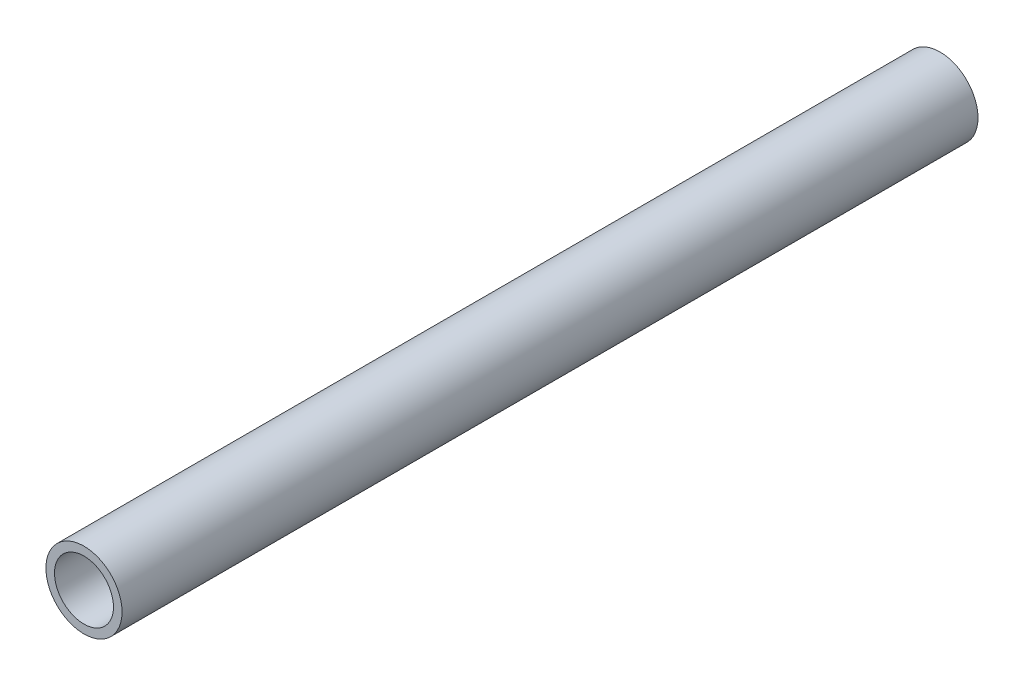
ISO-10303-21;
HEADER;
FILE_DESCRIPTION(('STEP AP214'),'2;1');
FILE_NAME('part.step','',(''),(''),'','','');
FILE_SCHEMA(('AUTOMOTIVE_DESIGN { 1 0 10303 214 1 1 1 1 }'));
ENDSEC;
DATA;
#1=APPLICATION_CONTEXT('core data for automotive mechanical design processes');
#2=APPLICATION_PROTOCOL_DEFINITION('international standard','automotive_design',2000,#1);
#3=PRODUCT_CONTEXT('',#1,'mechanical');
#4=PRODUCT('Part','Part','',(#3));
#5=PRODUCT_RELATED_PRODUCT_CATEGORY('part','',(#4));
#6=PRODUCT_DEFINITION_FORMATION('','',#4);
#7=PRODUCT_DEFINITION_CONTEXT('part definition',#1,'design');
#8=PRODUCT_DEFINITION('design','',#6,#7);
#9=PRODUCT_DEFINITION_SHAPE('','',#8);
#10=(LENGTH_UNIT() NAMED_UNIT(*) SI_UNIT(.MILLI.,.METRE.));
#11=(NAMED_UNIT(*) PLANE_ANGLE_UNIT() SI_UNIT($,.RADIAN.));
#12=(NAMED_UNIT(*) SI_UNIT($,.STERADIAN.) SOLID_ANGLE_UNIT());
#13=UNCERTAINTY_MEASURE_WITH_UNIT(LENGTH_MEASURE(1.E-05),#10,'distance_accuracy_value','');
#14=(GEOMETRIC_REPRESENTATION_CONTEXT(3) GLOBAL_UNCERTAINTY_ASSIGNED_CONTEXT((#13)) GLOBAL_UNIT_ASSIGNED_CONTEXT((#10,
#11,#12)) REPRESENTATION_CONTEXT('',''));
#15=CARTESIAN_POINT('',(0.,0.,0.));
#16=DIRECTION('',(0.,0.,1.));
#17=DIRECTION('',(1.,0.,0.));
#18=AXIS2_PLACEMENT_3D('',#15,#16,#17);
#19=CARTESIAN_POINT('',(0.,0.,150.));
#20=DIRECTION('',(0.,0.,1.));
#21=DIRECTION('',(1.,0.,0.));
#22=AXIS2_PLACEMENT_3D('',#19,#20,#21);
#23=PLANE('',#22);
#24=CARTESIAN_POINT('',(0.,0.,150.));
#25=DIRECTION('',(0.,0.,1.));
#26=DIRECTION('',(1.,0.,0.));
#27=AXIS2_PLACEMENT_3D('',#24,#25,#26);
#28=CIRCLE('',#27,13.335);
#29=CARTESIAN_POINT('',(13.335,0.,150.));
#30=VERTEX_POINT('',#29);
#31=EDGE_CURVE('E10',#30,#30,#28,.T.);
#32=ORIENTED_EDGE('',*,*,#31,.T.);
#33=EDGE_LOOP('',(#32));
#34=FACE_BOUND('',#33,.T.);
#35=CARTESIAN_POINT('',(0.,0.,150.));
#36=DIRECTION('',(0.,0.,1.));
#37=DIRECTION('',(1.,0.,0.));
#38=AXIS2_PLACEMENT_3D('',#35,#36,#37);
#39=CIRCLE('',#38,10.335);
#40=CARTESIAN_POINT('',(10.335,0.,150.));
#41=VERTEX_POINT('',#40);
#42=EDGE_CURVE('E54',#41,#41,#39,.T.);
#43=ORIENTED_EDGE('',*,*,#42,.F.);
#44=EDGE_LOOP('',(#43));
#45=FACE_BOUND('',#44,.T.);
#46=ADVANCED_FACE('F41',(#34,#45),#23,.T.);
#47=CARTESIAN_POINT('',(0.,0.,-150.));
#48=DIRECTION('',(0.,0.,1.));
#49=DIRECTION('',(1.,0.,0.));
#50=AXIS2_PLACEMENT_3D('',#47,#48,#49);
#51=PLANE('',#50);
#52=CARTESIAN_POINT('',(0.,0.,-150.));
#53=DIRECTION('',(0.,0.,1.));
#54=DIRECTION('',(1.,0.,0.));
#55=AXIS2_PLACEMENT_3D('',#52,#53,#54);
#56=CIRCLE('',#55,13.335);
#57=CARTESIAN_POINT('',(13.335,0.,-150.));
#58=VERTEX_POINT('',#57);
#59=EDGE_CURVE('E45',#58,#58,#56,.T.);
#60=ORIENTED_EDGE('',*,*,#59,.F.);
#61=EDGE_LOOP('',(#60));
#62=FACE_BOUND('',#61,.T.);
#63=CARTESIAN_POINT('',(0.,0.,-150.));
#64=DIRECTION('',(0.,0.,1.));
#65=DIRECTION('',(1.,0.,0.));
#66=AXIS2_PLACEMENT_3D('',#63,#64,#65);
#67=CIRCLE('',#66,10.335);
#68=CARTESIAN_POINT('',(10.335,0.,-150.));
#69=VERTEX_POINT('',#68);
#70=EDGE_CURVE('E56',#69,#69,#67,.T.);
#71=ORIENTED_EDGE('',*,*,#70,.T.);
#72=EDGE_LOOP('',(#71));
#73=FACE_BOUND('',#72,.T.);
#74=ADVANCED_FACE('F68',(#62,#73),#51,.F.);
#75=CARTESIAN_POINT('',(0.,0.,150.));
#76=DIRECTION('',(0.,0.,-1.));
#77=DIRECTION('',(-1.,0.,0.));
#78=AXIS2_PLACEMENT_3D('',#75,#76,#77);
#79=CYLINDRICAL_SURFACE('',#78,13.335);
#80=ORIENTED_EDGE('',*,*,#31,.F.);
#81=EDGE_LOOP('',(#80));
#82=FACE_BOUND('',#81,.T.);
#83=ORIENTED_EDGE('',*,*,#59,.T.);
#84=EDGE_LOOP('',(#83));
#85=FACE_BOUND('',#84,.T.);
#86=ADVANCED_FACE('F43',(#82,#85),#79,.T.);
#87=CARTESIAN_POINT('',(0.,0.,150.));
#88=DIRECTION('',(0.,0.,-1.));
#89=DIRECTION('',(-1.,0.,0.));
#90=AXIS2_PLACEMENT_3D('',#87,#88,#89);
#91=CYLINDRICAL_SURFACE('',#90,10.335);
#92=ORIENTED_EDGE('',*,*,#42,.T.);
#93=EDGE_LOOP('',(#92));
#94=FACE_BOUND('',#93,.T.);
#95=ORIENTED_EDGE('',*,*,#70,.F.);
#96=EDGE_LOOP('',(#95));
#97=FACE_BOUND('',#96,.T.);
#98=ADVANCED_FACE('F64',(#94,#97),#91,.F.);
#99=CLOSED_SHELL('',(#46,#74,#86,#98));
#100=MANIFOLD_SOLID_BREP('B2',#99);
#101=ADVANCED_BREP_SHAPE_REPRESENTATION('',(#18,#100),#14);
#102=SHAPE_DEFINITION_REPRESENTATION(#9,#101);
ENDSEC;
END-ISO-10303-21;
